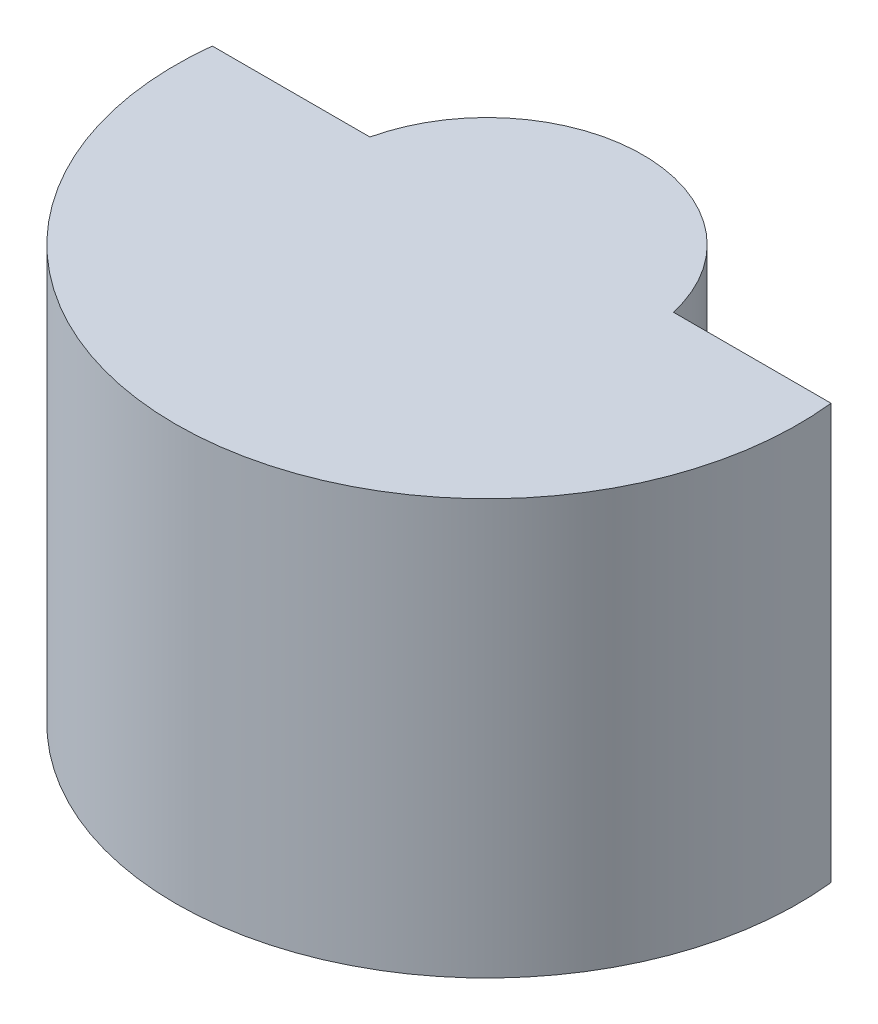
ISO-10303-21;
HEADER;
FILE_DESCRIPTION(('STEP AP214'),'2;1');
FILE_NAME('part.step','',(''),(''),'','','');
FILE_SCHEMA(('AUTOMOTIVE_DESIGN { 1 0 10303 214 1 1 1 1 }'));
ENDSEC;
DATA;
#1=APPLICATION_CONTEXT('core data for automotive mechanical design processes');
#2=APPLICATION_PROTOCOL_DEFINITION('international standard','automotive_design',2000,#1);
#3=PRODUCT_CONTEXT('',#1,'mechanical');
#4=PRODUCT('Part','Part','',(#3));
#5=PRODUCT_RELATED_PRODUCT_CATEGORY('part','',(#4));
#6=PRODUCT_DEFINITION_FORMATION('','',#4);
#7=PRODUCT_DEFINITION_CONTEXT('part definition',#1,'design');
#8=PRODUCT_DEFINITION('design','',#6,#7);
#9=PRODUCT_DEFINITION_SHAPE('','',#8);
#10=(LENGTH_UNIT() NAMED_UNIT(*) SI_UNIT(.MILLI.,.METRE.));
#11=(NAMED_UNIT(*) PLANE_ANGLE_UNIT() SI_UNIT($,.RADIAN.));
#12=(NAMED_UNIT(*) SI_UNIT($,.STERADIAN.) SOLID_ANGLE_UNIT());
#13=UNCERTAINTY_MEASURE_WITH_UNIT(LENGTH_MEASURE(1.E-05),#10,'distance_accuracy_value','');
#14=(GEOMETRIC_REPRESENTATION_CONTEXT(3) GLOBAL_UNCERTAINTY_ASSIGNED_CONTEXT((#13)) GLOBAL_UNIT_ASSIGNED_CONTEXT((#10,
#11,#12)) REPRESENTATION_CONTEXT('',''));
#15=CARTESIAN_POINT('',(0.,0.,0.));
#16=DIRECTION('',(0.,0.,1.));
#17=DIRECTION('',(1.,0.,0.));
#18=AXIS2_PLACEMENT_3D('',#15,#16,#17);
#19=CARTESIAN_POINT('',(0.,82.4500000000003,0.499999999999999));
#20=DIRECTION('',(0.,-1.,0.));
#21=DIRECTION('',(1.,0.,0.));
#22=AXIS2_PLACEMENT_3D('',#19,#20,#21);
#23=CYLINDRICAL_SURFACE('',#22,2.25);
#24=CARTESIAN_POINT('',(-1.7,79.4500000000003,-0.973940297298368));
#25=CARTESIAN_POINT('',(-1.69998919739464,79.3709681174881,-0.973962781733676));
#26=CARTESIAN_POINT('',(-1.69441728578065,79.2918478459687,-0.980454618451038));
#27=CARTESIAN_POINT('',(-1.67275152733022,79.1367981736452,-1.004871824233));
#28=CARTESIAN_POINT('',(-1.65661997812183,79.0608812479331,-1.02283815648474));
#29=CARTESIAN_POINT('',(-1.61092324931131,78.8992220815386,-1.07121961297113));
#30=CARTESIAN_POINT('',(-1.57929183082317,78.8146259340528,-1.103424443089));
#31=CARTESIAN_POINT('',(-1.50448673294198,78.6534837666418,-1.17381674097198));
#32=CARTESIAN_POINT('',(-1.46129786025725,78.5769485293987,-1.21201205620132));
#33=CARTESIAN_POINT('',(-1.36318835095113,78.4303599192344,-1.29116935304644));
#34=CARTESIAN_POINT('',(-1.30802106852251,78.3604957697047,-1.33217472762242));
#35=CARTESIAN_POINT('',(-1.1870505820444,78.2298251460174,-1.41277086056538));
#36=CARTESIAN_POINT('',(-1.12125648185231,78.1690110037641,-1.45236279467081));
#37=CARTESIAN_POINT('',(-0.982307223364556,78.0598404701375,-1.52570594321156));
#38=CARTESIAN_POINT('',(-0.90957186303701,78.0110712418349,-1.55963155925303));
#39=CARTESIAN_POINT('',(-0.755317275587038,77.92444833808,-1.62105548528515));
#40=CARTESIAN_POINT('',(-0.673799908734458,77.8865923571234,-1.6485551525721));
#41=CARTESIAN_POINT('',(-0.502735723802723,77.8234602517548,-1.69491860797852));
#42=CARTESIAN_POINT('',(-0.41312329643455,77.798300305565,-1.71370251926259));
#43=CARTESIAN_POINT('',(-0.229431241240468,77.7629688358079,-1.74018609194813));
#44=CARTESIAN_POINT('',(-0.135357444680986,77.7527782749737,-1.74789983151613));
#45=CARTESIAN_POINT('',(0.0389630667857502,77.7485590856477,-1.75108960509296));
#46=CARTESIAN_POINT('',(0.119135712205916,77.752307249937,-1.74824909403784));
#47=CARTESIAN_POINT('',(0.277429508917176,77.7708990007405,-1.73424307278333));
#48=CARTESIAN_POINT('',(0.355550615341481,77.785742829706,-1.72307738067044));
#49=CARTESIAN_POINT('',(0.505314092021846,77.8250449605342,-1.69381255544729));
#50=CARTESIAN_POINT('',(0.57708073210247,77.849200190841,-1.67593239963103));
#51=CARTESIAN_POINT('',(0.715360779942618,77.9060271719093,-1.63447302677519));
#52=CARTESIAN_POINT('',(0.781873275263736,77.9387003976938,-1.61089282273542));
#53=CARTESIAN_POINT('',(0.917237070685152,78.0162837857508,-1.55601318372677));
#54=CARTESIAN_POINT('',(0.985238617200979,78.062239821417,-1.52410571476033));
#55=CARTESIAN_POINT('',(1.11297187126189,78.1624073475525,-1.45678774893987));
#56=CARTESIAN_POINT('',(1.17269356557526,78.2166286701837,-1.42137309785176));
#57=CARTESIAN_POINT('',(1.29476951414348,78.3441634628914,-1.34184384869441));
#58=CARTESIAN_POINT('',(1.35520908639977,78.4191198375294,-1.29741942261415));
#59=CARTESIAN_POINT('',(1.46311946865423,78.5790325986882,-1.21071742827973));
#60=CARTESIAN_POINT('',(1.51059361209136,78.6639864067953,-1.16843931048525));
#61=CARTESIAN_POINT('',(1.57994585578156,78.8185038279192,-1.10246279157989));
#62=CARTESIAN_POINT('',(1.60526857316777,78.8857066226054,-1.07687821186281));
#63=CARTESIAN_POINT('',(1.6475665518301,79.0248168697046,-1.03263358766523));
#64=CARTESIAN_POINT('',(1.66456169198792,79.0967126494453,-1.01395707923659));
#65=CARTESIAN_POINT('',(1.68724742648771,79.2327554766682,-0.988605369442885));
#66=CARTESIAN_POINT('',(1.69426682359635,79.2964119415199,-0.980534208454068));
#67=CARTESIAN_POINT('',(1.70101897111758,79.4246065400799,-0.972774844981559));
#68=CARTESIAN_POINT('',(1.70075706069492,79.4891439930786,-0.973080500027214));
#69=CARTESIAN_POINT('',(1.69298601481074,79.617030526022,-0.982001218135104));
#70=CARTESIAN_POINT('',(1.68549182940721,79.6803817826462,-0.990599139974836));
#71=CARTESIAN_POINT('',(1.66380879776498,79.8045843267217,-1.01476028808416));
#72=CARTESIAN_POINT('',(1.64960910683912,79.8654313902561,-1.03033479534776));
#73=CARTESIAN_POINT('',(1.60701873798813,80.011931630667,-1.07522584704665));
#74=CARTESIAN_POINT('',(1.57509073580137,80.095619511029,-1.10755523084662));
#75=CARTESIAN_POINT('',(1.4998723496656,80.2551051886399,-1.17795873958329));
#76=CARTESIAN_POINT('',(1.4565566837886,80.3308848992661,-1.21604556572998));
#77=CARTESIAN_POINT('',(1.35765517680406,80.4770514701484,-1.29539534643431));
#78=CARTESIAN_POINT('',(1.30167502997854,80.5471355275243,-1.33672366135677));
#79=CARTESIAN_POINT('',(1.1789355156759,80.6780679768553,-1.41781643278597));
#80=CARTESIAN_POINT('',(1.11218659112506,80.738925206642,-1.45758235840992));
#81=CARTESIAN_POINT('',(0.972091247258845,80.8473008365525,-1.53062584689576));
#82=CARTESIAN_POINT('',(0.899287290666063,80.8953579014074,-1.56413646366863));
#83=CARTESIAN_POINT('',(0.745031761695469,80.9805814225982,-1.62468375939269));
#84=CARTESIAN_POINT('',(0.663582371297013,81.0177506180092,-1.6517220662777));
#85=CARTESIAN_POINT('',(0.492822855745425,81.0795493969622,-1.69715449423404));
#86=CARTESIAN_POINT('',(0.403449435460955,81.1040648738136,-1.71546984451863));
#87=CARTESIAN_POINT('',(0.220396215324803,81.1382122956771,-1.74107777565654));
#88=CARTESIAN_POINT('',(0.126721790705207,81.1478623241853,-1.74838374894251));
#89=CARTESIAN_POINT('',(-0.0469699793357758,81.1512303610473,-1.75093057463785));
#90=CARTESIAN_POINT('',(-0.126931515570313,81.1471180604046,-1.74781454910402));
#91=CARTESIAN_POINT('',(-0.284737958733634,81.1278676053346,-1.73331569270974));
#92=CARTESIAN_POINT('',(-0.362582795915431,81.1127290880399,-1.72193258978386));
#93=CARTESIAN_POINT('',(-0.512008243605181,81.0728598182836,-1.69225977704453));
#94=CARTESIAN_POINT('',(-0.583701184241865,81.0483988140633,-1.6741646429739));
#95=CARTESIAN_POINT('',(-0.721789591773543,80.9909791236519,-1.63230651514375));
#96=CARTESIAN_POINT('',(-0.788184179108843,80.9580190303859,-1.60854258292965));
#97=CARTESIAN_POINT('',(-0.923382040184302,80.8797757081389,-1.55326289527825));
#98=CARTESIAN_POINT('',(-0.99131856705366,80.8334336175801,-1.52113534165358));
#99=CARTESIAN_POINT('',(-1.11887023759812,80.7324814663955,-1.45342164419833));
#100=CARTESIAN_POINT('',(-1.17847479656529,80.6778610694659,-1.41783119676774));
#101=CARTESIAN_POINT('',(-1.30023889282433,80.5494222881644,-1.33798484463628));
#102=CARTESIAN_POINT('',(-1.36047058643327,80.4739562336533,-1.29343389993679));
#103=CARTESIAN_POINT('',(-1.46786499061969,80.312977221908,-1.20664008165349));
#104=CARTESIAN_POINT('',(-1.5150324714387,80.2274679481194,-1.16439637014616));
#105=CARTESIAN_POINT('',(-1.58312998778224,80.0733341923191,-1.09928964734744));
#106=CARTESIAN_POINT('',(-1.60769472595276,80.0071825399106,-1.07438763984498));
#107=CARTESIAN_POINT('',(-1.64873913172048,79.8703852036563,-1.03135518459805));
#108=CARTESIAN_POINT('',(-1.66524235122711,79.7997533004415,-1.01320504860866));
#109=CARTESIAN_POINT('',(-1.68470354631401,79.6821424616411,-0.991442517645592));
#110=CARTESIAN_POINT('',(-1.69041689288573,79.6361463162973,-0.984933509091046));
#111=CARTESIAN_POINT('',(-1.69806793758136,79.5434436554926,-0.976176175251729));
#112=CARTESIAN_POINT('',(-1.70000638836396,79.4967372835127,-0.973927000621203));
#113=CARTESIAN_POINT('',(-1.7,79.4500000000003,-0.973940297298368));
#114=B_SPLINE_CURVE_WITH_KNOTS('',3,(#24,#25,#26,#27,#28,#29,#30,#31,#32,#33,#34,#35,#36,#37,
#38,#39,#40,#41,#42,#43,#44,#45,#46,#47,#48,#49,#50,#51,#52,#53,#54,#55,#56,#57,#58,#59,#60,#61,
#62,#63,#64,#65,#66,#67,#68,#69,#70,#71,#72,#73,#74,#75,#76,#77,#78,#79,#80,#81,#82,#83,#84,#85,
#86,#87,#88,#89,#90,#91,#92,#93,#94,#95,#96,#97,#98,#99,#100,#101,#102,#103,#104,#105,#106,#107,
#108,#109,#110,#111,#112,#113),.UNSPECIFIED.,.T.,.F.,(4,2,2,2,2,2,2,2,2,2,2,2,2,2,2,2,2,2,2,2,2,
2,2,2,2,2,2,2,2,2,2,2,2,2,2,2,2,2,2,2,2,2,2,2,4),(0.,0.236847528098202,0.474545348670271,
0.760633328218946,1.04709925902867,1.34014397635488,1.63293896479551,1.91356013110297,
2.19412197059822,2.47720660663819,2.75993091809725,2.99963706203656,3.23934844394792,
3.47183932904494,3.70437050031442,3.96758909528261,4.23112328733902,4.54800863430632,
4.86481243252344,5.09281581580047,5.32027224468767,5.51303774951926,5.70566190891011,
5.89788873998804,6.09042752620068,6.37453636523654,6.65928136483864,6.95454963038628,
7.24953326450067,7.52876868537722,7.80793379819294,8.0895741744254,8.37087166992365,
8.61003896677653,8.84921413486333,9.08193796303723,9.31470034479623,9.57861245520441,
9.84285684343928,10.1606237850967,10.4782745445217,10.7021011050063,10.9252697808715,
11.065362835746,11.2054279552655),.UNSPECIFIED.);
#115=CARTESIAN_POINT('',(-1.7,79.4500000000003,-0.973940297298368));
#116=VERTEX_POINT('',#115);
#117=EDGE_CURVE('E41',#116,#116,#114,.T.);
#118=ORIENTED_EDGE('',*,*,#117,.T.);
#119=EDGE_LOOP('',(#118));
#120=FACE_BOUND('',#119,.T.);
#121=CARTESIAN_POINT('',(0.,76.4500000000003,0.499999999999999));
#122=DIRECTION('',(0.,1.,0.));
#123=DIRECTION('',(1.,0.,0.));
#124=AXIS2_PLACEMENT_3D('',#121,#122,#123);
#125=CIRCLE('',#124,2.25);
#126=CARTESIAN_POINT('',(2.19374109684803,76.4500000000003,0.));
#127=VERTEX_POINT('',#126);
#128=CARTESIAN_POINT('',(-2.19374109684803,76.4500000000003,0.));
#129=VERTEX_POINT('',#128);
#130=EDGE_CURVE('E107',#127,#129,#125,.T.);
#131=ORIENTED_EDGE('',*,*,#130,.T.);
#132=DIRECTION('',(0.,-1.,0.));
#133=VECTOR('',#132,1.);
#134=CARTESIAN_POINT('',(-2.19374109684803,82.4500000000003,0.));
#135=LINE('',#134,#133);
#136=CARTESIAN_POINT('',(-2.19374109684803,82.4500000000003,0.));
#137=VERTEX_POINT('',#136);
#138=EDGE_CURVE('E11',#137,#129,#135,.T.);
#139=ORIENTED_EDGE('',*,*,#138,.F.);
#140=CARTESIAN_POINT('',(0.,82.4500000000003,0.499999999999999));
#141=DIRECTION('',(0.,1.,0.));
#142=DIRECTION('',(1.,0.,0.));
#143=AXIS2_PLACEMENT_3D('',#140,#141,#142);
#144=CIRCLE('',#143,2.25);
#145=CARTESIAN_POINT('',(2.19374109684803,82.4500000000003,0.));
#146=VERTEX_POINT('',#145);
#147=EDGE_CURVE('E94',#146,#137,#144,.T.);
#148=ORIENTED_EDGE('',*,*,#147,.F.);
#149=DIRECTION('',(0.,-1.,0.));
#150=VECTOR('',#149,1.);
#151=CARTESIAN_POINT('',(2.19374109684803,82.4500000000003,0.));
#152=LINE('',#151,#150);
#153=EDGE_CURVE('E103',#146,#127,#152,.T.);
#154=ORIENTED_EDGE('',*,*,#153,.T.);
#155=EDGE_LOOP('',(#131,#139,#148,#154));
#156=FACE_BOUND('',#155,.T.);
#157=ADVANCED_FACE('F37',(#120,#156),#23,.T.);
#158=CARTESIAN_POINT('',(-4.47213595499958,82.4500000000003,0.));
#159=DIRECTION('',(0.,0.,1.));
#160=DIRECTION('',(0.,-1.,0.));
#161=AXIS2_PLACEMENT_3D('',#158,#159,#160);
#162=PLANE('',#161);
#163=DIRECTION('',(-1.,0.,0.));
#164=VECTOR('',#163,1.);
#165=CARTESIAN_POINT('',(-4.47213595499958,76.4500000000003,0.));
#166=LINE('',#165,#164);
#167=CARTESIAN_POINT('',(-4.47213595499958,76.4500000000003,0.));
#168=VERTEX_POINT('',#167);
#169=EDGE_CURVE('E98',#129,#168,#166,.T.);
#170=ORIENTED_EDGE('',*,*,#169,.T.);
#171=DIRECTION('',(0.,-1.,0.));
#172=VECTOR('',#171,1.);
#173=CARTESIAN_POINT('',(-4.47213595499958,82.4500000000003,0.));
#174=LINE('',#173,#172);
#175=CARTESIAN_POINT('',(-4.47213595499958,82.4500000000003,0.));
#176=VERTEX_POINT('',#175);
#177=EDGE_CURVE('E51',#176,#168,#174,.T.);
#178=ORIENTED_EDGE('',*,*,#177,.F.);
#179=DIRECTION('',(-1.,0.,0.));
#180=VECTOR('',#179,1.);
#181=CARTESIAN_POINT('',(-4.47213595499958,82.4500000000003,0.));
#182=LINE('',#181,#180);
#183=EDGE_CURVE('E89',#137,#176,#182,.T.);
#184=ORIENTED_EDGE('',*,*,#183,.F.);
#185=ORIENTED_EDGE('',*,*,#138,.T.);
#186=EDGE_LOOP('',(#170,#178,#184,#185));
#187=FACE_BOUND('',#186,.T.);
#188=ADVANCED_FACE('F97',(#187),#162,.F.);
#189=CARTESIAN_POINT('',(0.,82.4500000000003,0.499999999999999));
#190=DIRECTION('',(0.,-1.,0.));
#191=DIRECTION('',(1.,0.,0.));
#192=AXIS2_PLACEMENT_3D('',#189,#190,#191);
#193=CYLINDRICAL_SURFACE('',#192,4.5);
#194=CARTESIAN_POINT('',(0.,76.4500000000003,0.499999999999999));
#195=DIRECTION('',(0.,1.,0.));
#196=DIRECTION('',(-1.,0.,0.));
#197=AXIS2_PLACEMENT_3D('',#194,#195,#196);
#198=CIRCLE('',#197,4.5);
#199=CARTESIAN_POINT('',(4.47213595499958,76.4500000000003,0.));
#200=VERTEX_POINT('',#199);
#201=EDGE_CURVE('E76',#168,#200,#198,.T.);
#202=ORIENTED_EDGE('',*,*,#201,.T.);
#203=DIRECTION('',(0.,-1.,0.));
#204=VECTOR('',#203,1.);
#205=CARTESIAN_POINT('',(4.47213595499958,82.4500000000003,0.));
#206=LINE('',#205,#204);
#207=CARTESIAN_POINT('',(4.47213595499958,82.4500000000003,0.));
#208=VERTEX_POINT('',#207);
#209=EDGE_CURVE('E99',#208,#200,#206,.T.);
#210=ORIENTED_EDGE('',*,*,#209,.F.);
#211=CARTESIAN_POINT('',(0.,82.4500000000003,0.499999999999999));
#212=DIRECTION('',(0.,1.,0.));
#213=DIRECTION('',(-1.,0.,0.));
#214=AXIS2_PLACEMENT_3D('',#211,#212,#213);
#215=CIRCLE('',#214,4.5);
#216=EDGE_CURVE('E92',#176,#208,#215,.T.);
#217=ORIENTED_EDGE('',*,*,#216,.F.);
#218=ORIENTED_EDGE('',*,*,#177,.T.);
#219=EDGE_LOOP('',(#202,#210,#217,#218));
#220=FACE_BOUND('',#219,.T.);
#221=ADVANCED_FACE('F101',(#220),#193,.T.);
#222=CARTESIAN_POINT('',(2.19374109684803,82.4500000000003,0.));
#223=DIRECTION('',(0.,0.,1.));
#224=DIRECTION('',(0.,-1.,0.));
#225=AXIS2_PLACEMENT_3D('',#222,#223,#224);
#226=PLANE('',#225);
#227=DIRECTION('',(-1.,0.,0.));
#228=VECTOR('',#227,1.);
#229=CARTESIAN_POINT('',(2.19374109684803,76.4500000000003,0.));
#230=LINE('',#229,#228);
#231=EDGE_CURVE('E82',#200,#127,#230,.T.);
#232=ORIENTED_EDGE('',*,*,#231,.T.);
#233=ORIENTED_EDGE('',*,*,#153,.F.);
#234=DIRECTION('',(-1.,0.,0.));
#235=VECTOR('',#234,1.);
#236=CARTESIAN_POINT('',(2.19374109684803,82.4500000000003,0.));
#237=LINE('',#236,#235);
#238=EDGE_CURVE('E59',#208,#146,#237,.T.);
#239=ORIENTED_EDGE('',*,*,#238,.F.);
#240=ORIENTED_EDGE('',*,*,#209,.T.);
#241=EDGE_LOOP('',(#232,#233,#239,#240));
#242=FACE_BOUND('',#241,.T.);
#243=ADVANCED_FACE('F114',(#242),#226,.F.);
#244=CARTESIAN_POINT('',(0.,82.4500000000003,0.499999999999999));
#245=DIRECTION('',(0.,-1.,0.));
#246=DIRECTION('',(1.,0.,0.));
#247=AXIS2_PLACEMENT_3D('',#244,#245,#246);
#248=PLANE('',#247);
#249=ORIENTED_EDGE('',*,*,#147,.T.);
#250=ORIENTED_EDGE('',*,*,#183,.T.);
#251=ORIENTED_EDGE('',*,*,#216,.T.);
#252=ORIENTED_EDGE('',*,*,#238,.T.);
#253=EDGE_LOOP('',(#249,#250,#251,#252));
#254=FACE_BOUND('',#253,.T.);
#255=ADVANCED_FACE('F90',(#254),#248,.F.);
#256=CARTESIAN_POINT('',(0.,76.4500000000003,0.499999999999999));
#257=DIRECTION('',(0.,-1.,0.));
#258=DIRECTION('',(1.,0.,0.));
#259=AXIS2_PLACEMENT_3D('',#256,#257,#258);
#260=PLANE('',#259);
#261=ORIENTED_EDGE('',*,*,#130,.F.);
#262=ORIENTED_EDGE('',*,*,#231,.F.);
#263=ORIENTED_EDGE('',*,*,#201,.F.);
#264=ORIENTED_EDGE('',*,*,#169,.F.);
#265=EDGE_LOOP('',(#261,#262,#263,#264));
#266=FACE_BOUND('',#265,.T.);
#267=ADVANCED_FACE('F117',(#266),#260,.T.);
#268=CARTESIAN_POINT('',(0.,79.4500000000003,-1.75));
#269=DIRECTION('',(0.,0.,-1.));
#270=DIRECTION('',(-1.,0.,0.));
#271=AXIS2_PLACEMENT_3D('',#268,#269,#270);
#272=CYLINDRICAL_SURFACE('',#271,1.7);
#273=CARTESIAN_POINT('',(0.,79.4500000000003,3.02605970270163));
#274=DIRECTION('',(0.,0.,-1.));
#275=DIRECTION('',(-1.,0.,0.));
#276=AXIS2_PLACEMENT_3D('',#273,#274,#275);
#277=CIRCLE('',#276,1.7);
#278=CARTESIAN_POINT('',(-1.7,79.4500000000003,3.02605970270163));
#279=VERTEX_POINT('',#278);
#280=EDGE_CURVE('E120',#279,#279,#277,.T.);
#281=ORIENTED_EDGE('',*,*,#280,.F.);
#282=EDGE_LOOP('',(#281));
#283=FACE_BOUND('',#282,.T.);
#284=ORIENTED_EDGE('',*,*,#117,.F.);
#285=EDGE_LOOP('',(#284));
#286=FACE_BOUND('',#285,.T.);
#287=ADVANCED_FACE('F128',(#283,#286),#272,.F.);
#288=CARTESIAN_POINT('',(1.7,79.4500000000003,3.02605970270163));
#289=DIRECTION('',(0.,0.,1.));
#290=DIRECTION('',(1.,0.,0.));
#291=AXIS2_PLACEMENT_3D('',#288,#289,#290);
#292=PLANE('',#291);
#293=ORIENTED_EDGE('',*,*,#280,.T.);
#294=EDGE_LOOP('',(#293));
#295=FACE_BOUND('',#294,.T.);
#296=ADVANCED_FACE('F130',(#295),#292,.F.);
#297=CLOSED_SHELL('',(#157,#188,#221,#243,#255,#267,#287,#296));
#298=MANIFOLD_SOLID_BREP('B2',#297);
#299=ADVANCED_BREP_SHAPE_REPRESENTATION('',(#18,#298),#14);
#300=SHAPE_DEFINITION_REPRESENTATION(#9,#299);
ENDSEC;
END-ISO-10303-21;
